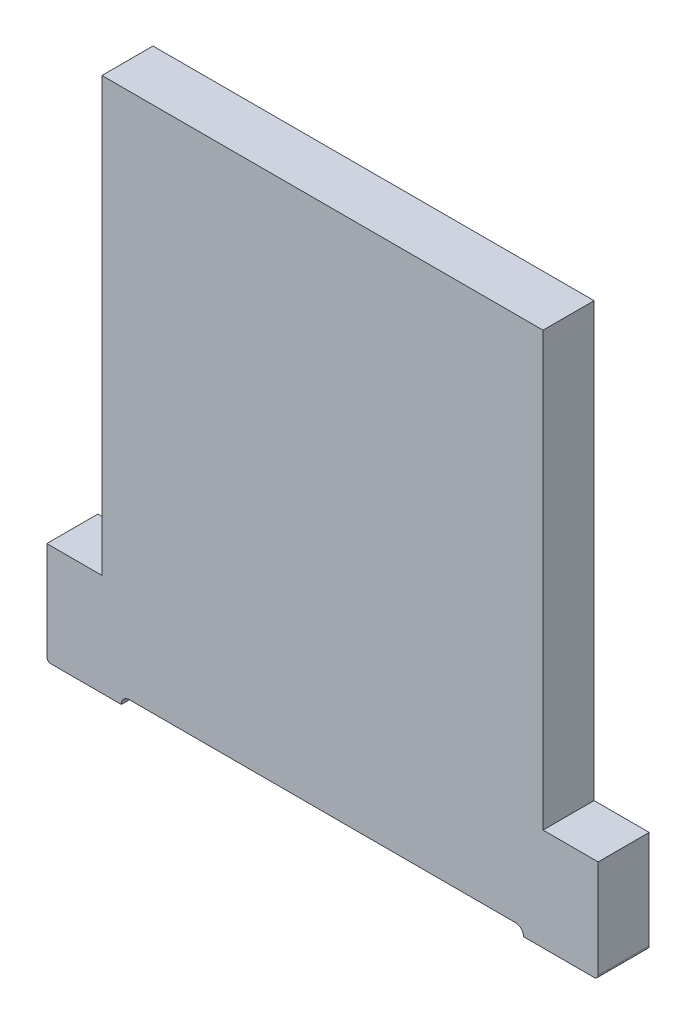
ISO-10303-21;
HEADER;
FILE_DESCRIPTION(('STEP AP214'),'2;1');
FILE_NAME('part.step','',(''),(''),'','','');
FILE_SCHEMA(('AUTOMOTIVE_DESIGN { 1 0 10303 214 1 1 1 1 }'));
ENDSEC;
DATA;
#1=APPLICATION_CONTEXT('core data for automotive mechanical design processes');
#2=APPLICATION_PROTOCOL_DEFINITION('international standard','automotive_design',2000,#1);
#3=PRODUCT_CONTEXT('',#1,'mechanical');
#4=PRODUCT('Part','Part','',(#3));
#5=PRODUCT_RELATED_PRODUCT_CATEGORY('part','',(#4));
#6=PRODUCT_DEFINITION_FORMATION('','',#4);
#7=PRODUCT_DEFINITION_CONTEXT('part definition',#1,'design');
#8=PRODUCT_DEFINITION('design','',#6,#7);
#9=PRODUCT_DEFINITION_SHAPE('','',#8);
#10=(LENGTH_UNIT() NAMED_UNIT(*) SI_UNIT(.MILLI.,.METRE.));
#11=(NAMED_UNIT(*) PLANE_ANGLE_UNIT() SI_UNIT($,.RADIAN.));
#12=(NAMED_UNIT(*) SI_UNIT($,.STERADIAN.) SOLID_ANGLE_UNIT());
#13=UNCERTAINTY_MEASURE_WITH_UNIT(LENGTH_MEASURE(1.E-05),#10,'distance_accuracy_value','');
#14=(GEOMETRIC_REPRESENTATION_CONTEXT(3) GLOBAL_UNCERTAINTY_ASSIGNED_CONTEXT((#13)) GLOBAL_UNIT_ASSIGNED_CONTEXT((#10,
#11,#12)) REPRESENTATION_CONTEXT('',''));
#15=CARTESIAN_POINT('',(0.,0.,0.));
#16=DIRECTION('',(0.,0.,1.));
#17=DIRECTION('',(1.,0.,0.));
#18=AXIS2_PLACEMENT_3D('',#15,#16,#17);
#19=CARTESIAN_POINT('',(131.144744279938,94.5570432923501,142.211582908599));
#20=DIRECTION('',(0.,1.,0.));
#21=DIRECTION('',(1.,0.,0.));
#22=AXIS2_PLACEMENT_3D('',#19,#20,#21);
#23=PLANE('',#22);
#24=DIRECTION('',(0.,0.,1.));
#25=VECTOR('',#24,1.);
#26=CARTESIAN_POINT('',(131.144744279938,94.5570432923501,142.211582908599));
#27=LINE('',#26,#25);
#28=CARTESIAN_POINT('',(131.144744279938,94.5570432923501,142.211582908599));
#29=VERTEX_POINT('',#28);
#30=CARTESIAN_POINT('',(131.144744279938,94.5570432923501,142.711582908599));
#31=VERTEX_POINT('',#30);
#32=EDGE_CURVE('E11',#29,#31,#27,.T.);
#33=ORIENTED_EDGE('',*,*,#32,.T.);
#34=DIRECTION('',(1.,0.,0.));
#35=VECTOR('',#34,1.);
#36=CARTESIAN_POINT('',(131.144744279938,94.5570432923501,142.711582908599));
#37=LINE('',#36,#35);
#38=CARTESIAN_POINT('',(131.684744279938,94.5570432923501,142.711582908599));
#39=VERTEX_POINT('',#38);
#40=EDGE_CURVE('E55',#31,#39,#37,.T.);
#41=ORIENTED_EDGE('',*,*,#40,.T.);
#42=DIRECTION('',(0.,0.,1.));
#43=VECTOR('',#42,1.);
#44=CARTESIAN_POINT('',(131.684744279938,94.5570432923501,142.211582908599));
#45=LINE('',#44,#43);
#46=CARTESIAN_POINT('',(131.684744279938,94.5570432923501,142.211582908599));
#47=VERTEX_POINT('',#46);
#48=EDGE_CURVE('E245',#47,#39,#45,.T.);
#49=ORIENTED_EDGE('',*,*,#48,.F.);
#50=DIRECTION('',(1.,0.,0.));
#51=VECTOR('',#50,1.);
#52=CARTESIAN_POINT('',(131.144744279938,94.5570432923501,142.211582908599));
#53=LINE('',#52,#51);
#54=EDGE_CURVE('E223',#29,#47,#53,.T.);
#55=ORIENTED_EDGE('',*,*,#54,.F.);
#56=EDGE_LOOP('',(#33,#41,#49,#55));
#57=FACE_BOUND('',#56,.T.);
#58=ADVANCED_FACE('F44',(#57),#23,.T.);
#59=CARTESIAN_POINT('',(131.684744279938,94.5570432923501,142.211582908599));
#60=DIRECTION('',(-1.,0.,0.));
#61=DIRECTION('',(0.,0.,1.));
#62=AXIS2_PLACEMENT_3D('',#59,#60,#61);
#63=PLANE('',#62);
#64=ORIENTED_EDGE('',*,*,#48,.T.);
#65=DIRECTION('',(0.,1.,0.));
#66=VECTOR('',#65,1.);
#67=CARTESIAN_POINT('',(131.684744279938,94.5570432923501,142.711582908599));
#68=LINE('',#67,#66);
#69=CARTESIAN_POINT('',(131.684744279938,98.7970432923501,142.711582908599));
#70=VERTEX_POINT('',#69);
#71=EDGE_CURVE('E227',#39,#70,#68,.T.);
#72=ORIENTED_EDGE('',*,*,#71,.T.);
#73=DIRECTION('',(0.,0.,1.));
#74=VECTOR('',#73,1.);
#75=CARTESIAN_POINT('',(131.684744279938,98.7970432923501,142.211582908599));
#76=LINE('',#75,#74);
#77=CARTESIAN_POINT('',(131.684744279938,98.7970432923501,142.211582908599));
#78=VERTEX_POINT('',#77);
#79=EDGE_CURVE('E225',#78,#70,#76,.T.);
#80=ORIENTED_EDGE('',*,*,#79,.F.);
#81=DIRECTION('',(0.,1.,0.));
#82=VECTOR('',#81,1.);
#83=CARTESIAN_POINT('',(131.684744279938,94.5570432923501,142.211582908599));
#84=LINE('',#83,#82);
#85=EDGE_CURVE('E220',#47,#78,#84,.T.);
#86=ORIENTED_EDGE('',*,*,#85,.F.);
#87=EDGE_LOOP('',(#64,#72,#80,#86));
#88=FACE_BOUND('',#87,.T.);
#89=ADVANCED_FACE('F305',(#88),#63,.T.);
#90=CARTESIAN_POINT('',(131.684744279938,98.7970432923501,142.211582908599));
#91=DIRECTION('',(0.,1.,0.));
#92=DIRECTION('',(1.,0.,0.));
#93=AXIS2_PLACEMENT_3D('',#90,#91,#92);
#94=PLANE('',#93);
#95=ORIENTED_EDGE('',*,*,#79,.T.);
#96=DIRECTION('',(1.,0.,0.));
#97=VECTOR('',#96,1.);
#98=CARTESIAN_POINT('',(131.684744279938,98.7970432923501,142.711582908599));
#99=LINE('',#98,#97);
#100=CARTESIAN_POINT('',(136.004744279938,98.7970432923501,142.711582908599));
#101=VERTEX_POINT('',#100);
#102=EDGE_CURVE('E228',#70,#101,#99,.T.);
#103=ORIENTED_EDGE('',*,*,#102,.T.);
#104=DIRECTION('',(0.,0.,1.));
#105=VECTOR('',#104,1.);
#106=CARTESIAN_POINT('',(136.004744279938,98.7970432923501,142.211582908599));
#107=LINE('',#106,#105);
#108=CARTESIAN_POINT('',(136.004744279938,98.7970432923501,142.211582908599));
#109=VERTEX_POINT('',#108);
#110=EDGE_CURVE('E233',#109,#101,#107,.T.);
#111=ORIENTED_EDGE('',*,*,#110,.F.);
#112=DIRECTION('',(1.,0.,0.));
#113=VECTOR('',#112,1.);
#114=CARTESIAN_POINT('',(131.684744279938,98.7970432923501,142.211582908599));
#115=LINE('',#114,#113);
#116=EDGE_CURVE('E224',#78,#109,#115,.T.);
#117=ORIENTED_EDGE('',*,*,#116,.F.);
#118=EDGE_LOOP('',(#95,#103,#111,#117));
#119=FACE_BOUND('',#118,.T.);
#120=ADVANCED_FACE('F418',(#119),#94,.T.);
#121=CARTESIAN_POINT('',(136.004744279938,98.7970432923501,142.211582908599));
#122=DIRECTION('',(1.,0.,0.));
#123=DIRECTION('',(0.,1.,0.));
#124=AXIS2_PLACEMENT_3D('',#121,#122,#123);
#125=PLANE('',#124);
#126=ORIENTED_EDGE('',*,*,#110,.T.);
#127=DIRECTION('',(0.,-1.,0.));
#128=VECTOR('',#127,1.);
#129=CARTESIAN_POINT('',(136.004744279938,98.7970432923501,142.711582908599));
#130=LINE('',#129,#128);
#131=CARTESIAN_POINT('',(136.004744279938,94.5570432923501,142.711582908599));
#132=VERTEX_POINT('',#131);
#133=EDGE_CURVE('E218',#101,#132,#130,.T.);
#134=ORIENTED_EDGE('',*,*,#133,.T.);
#135=DIRECTION('',(0.,0.,1.));
#136=VECTOR('',#135,1.);
#137=CARTESIAN_POINT('',(136.004744279938,94.5570432923501,142.211582908599));
#138=LINE('',#137,#136);
#139=CARTESIAN_POINT('',(136.004744279938,94.5570432923501,142.211582908599));
#140=VERTEX_POINT('',#139);
#141=EDGE_CURVE('E215',#140,#132,#138,.T.);
#142=ORIENTED_EDGE('',*,*,#141,.F.);
#143=DIRECTION('',(0.,-1.,0.));
#144=VECTOR('',#143,1.);
#145=CARTESIAN_POINT('',(136.004744279938,98.7970432923501,142.211582908599));
#146=LINE('',#145,#144);
#147=EDGE_CURVE('E286',#109,#140,#146,.T.);
#148=ORIENTED_EDGE('',*,*,#147,.F.);
#149=EDGE_LOOP('',(#126,#134,#142,#148));
#150=FACE_BOUND('',#149,.T.);
#151=ADVANCED_FACE('F414',(#150),#125,.T.);
#152=CARTESIAN_POINT('',(136.004744279938,94.5570432923501,142.211582908599));
#153=DIRECTION('',(0.,1.,0.));
#154=DIRECTION('',(1.,0.,0.));
#155=AXIS2_PLACEMENT_3D('',#152,#153,#154);
#156=PLANE('',#155);
#157=ORIENTED_EDGE('',*,*,#141,.T.);
#158=DIRECTION('',(1.,0.,0.));
#159=VECTOR('',#158,1.);
#160=CARTESIAN_POINT('',(136.004744279938,94.5570432923501,142.711582908599));
#161=LINE('',#160,#159);
#162=CARTESIAN_POINT('',(136.544744279938,94.5570432923501,142.711582908599));
#163=VERTEX_POINT('',#162);
#164=EDGE_CURVE('E219',#132,#163,#161,.T.);
#165=ORIENTED_EDGE('',*,*,#164,.T.);
#166=DIRECTION('',(0.,0.,1.));
#167=VECTOR('',#166,1.);
#168=CARTESIAN_POINT('',(136.544744279938,94.5570432923501,142.211582908599));
#169=LINE('',#168,#167);
#170=CARTESIAN_POINT('',(136.544744279938,94.5570432923501,142.211582908599));
#171=VERTEX_POINT('',#170);
#172=EDGE_CURVE('E270',#171,#163,#169,.T.);
#173=ORIENTED_EDGE('',*,*,#172,.F.);
#174=DIRECTION('',(1.,0.,0.));
#175=VECTOR('',#174,1.);
#176=CARTESIAN_POINT('',(136.004744279938,94.5570432923501,142.211582908599));
#177=LINE('',#176,#175);
#178=EDGE_CURVE('E283',#140,#171,#177,.T.);
#179=ORIENTED_EDGE('',*,*,#178,.F.);
#180=EDGE_LOOP('',(#157,#165,#173,#179));
#181=FACE_BOUND('',#180,.T.);
#182=ADVANCED_FACE('F353',(#181),#156,.T.);
#183=CARTESIAN_POINT('',(136.544744279938,94.5570432923501,142.211582908599));
#184=DIRECTION('',(1.,0.,0.));
#185=DIRECTION('',(0.,1.,0.));
#186=AXIS2_PLACEMENT_3D('',#183,#184,#185);
#187=PLANE('',#186);
#188=DIRECTION('',(0.,-1.,0.));
#189=VECTOR('',#188,1.);
#190=CARTESIAN_POINT('',(136.544744279938,94.5570432923501,142.211582908599));
#191=LINE('',#190,#189);
#192=CARTESIAN_POINT('',(136.544744279938,93.5970432923501,142.211582908599));
#193=VERTEX_POINT('',#192);
#194=EDGE_CURVE('E250',#171,#193,#191,.T.);
#195=ORIENTED_EDGE('',*,*,#194,.F.);
#196=ORIENTED_EDGE('',*,*,#172,.T.);
#197=DIRECTION('',(0.,-1.,0.));
#198=VECTOR('',#197,1.);
#199=CARTESIAN_POINT('',(136.544744279938,94.5570432923501,142.711582908599));
#200=LINE('',#199,#198);
#201=CARTESIAN_POINT('',(136.544744279938,93.5970432923501,142.711582908599));
#202=VERTEX_POINT('',#201);
#203=EDGE_CURVE('E214',#163,#202,#200,.T.);
#204=ORIENTED_EDGE('',*,*,#203,.T.);
#205=DIRECTION('',(0.,0.,1.));
#206=VECTOR('',#205,1.);
#207=CARTESIAN_POINT('',(136.544744279938,93.5970432923501,142.211582908599));
#208=LINE('',#207,#206);
#209=EDGE_CURVE('E211',#193,#202,#208,.T.);
#210=ORIENTED_EDGE('',*,*,#209,.F.);
#211=EDGE_LOOP('',(#195,#196,#204,#210));
#212=FACE_BOUND('',#211,.T.);
#213=ADVANCED_FACE('F347',(#212),#187,.T.);
#214=CARTESIAN_POINT('',(136.504744279938,93.5970432923501,142.211582908599));
#215=DIRECTION('',(0.,0.,1.));
#216=DIRECTION('',(0.,-1.,0.));
#217=AXIS2_PLACEMENT_3D('',#214,#215,#216);
#218=CYLINDRICAL_SURFACE('',#217,0.0399999999999983);
#219=CARTESIAN_POINT('',(136.504744279938,93.5970432923501,142.211582908599));
#220=DIRECTION('',(0.,0.,1.));
#221=DIRECTION('',(-1.,0.,0.));
#222=AXIS2_PLACEMENT_3D('',#219,#220,#221);
#223=CIRCLE('',#222,0.0400000000000123);
#224=CARTESIAN_POINT('',(136.504744279938,93.5570432923501,142.211582908599));
#225=VERTEX_POINT('',#224);
#226=EDGE_CURVE('E212',#225,#193,#223,.T.);
#227=ORIENTED_EDGE('',*,*,#226,.T.);
#228=ORIENTED_EDGE('',*,*,#209,.T.);
#229=CARTESIAN_POINT('',(136.504744279938,93.5970432923501,142.711582908599));
#230=DIRECTION('',(0.,0.,1.));
#231=DIRECTION('',(-1.,0.,0.));
#232=AXIS2_PLACEMENT_3D('',#229,#230,#231);
#233=CIRCLE('',#232,0.0400000000000123);
#234=CARTESIAN_POINT('',(136.504744279938,93.5570432923501,142.711582908599));
#235=VERTEX_POINT('',#234);
#236=EDGE_CURVE('E132',#235,#202,#233,.T.);
#237=ORIENTED_EDGE('',*,*,#236,.F.);
#238=DIRECTION('',(0.,0.,1.));
#239=VECTOR('',#238,1.);
#240=CARTESIAN_POINT('',(136.504744279938,93.5570432923501,142.211582908599));
#241=LINE('',#240,#239);
#242=EDGE_CURVE('E125',#225,#235,#241,.T.);
#243=ORIENTED_EDGE('',*,*,#242,.F.);
#244=EDGE_LOOP('',(#227,#228,#237,#243));
#245=FACE_BOUND('',#244,.T.);
#246=ADVANCED_FACE('F46',(#245),#218,.T.);
#247=CARTESIAN_POINT('',(133.844744279938,93.5570432923501,142.211582908599));
#248=DIRECTION('',(0.,-1.,0.));
#249=DIRECTION('',(0.,0.,-1.));
#250=AXIS2_PLACEMENT_3D('',#247,#248,#249);
#251=PLANE('',#250);
#252=DIRECTION('',(0.,0.,-1.));
#253=VECTOR('',#252,1.);
#254=CARTESIAN_POINT('',(135.814744279938,93.5570432923501,142.211582908599));
#255=LINE('',#254,#253);
#256=CARTESIAN_POINT('',(135.814744279938,93.5570432923501,142.711582908599));
#257=VERTEX_POINT('',#256);
#258=CARTESIAN_POINT('',(135.814744279938,93.5570432923501,142.211582908599));
#259=VERTEX_POINT('',#258);
#260=EDGE_CURVE('E238',#257,#259,#255,.T.);
#261=ORIENTED_EDGE('',*,*,#260,.T.);
#262=DIRECTION('',(1.,0.,0.));
#263=VECTOR('',#262,1.);
#264=CARTESIAN_POINT('',(131.144744279938,93.5570432923501,142.211582908599));
#265=LINE('',#264,#263);
#266=EDGE_CURVE('E234',#259,#225,#265,.T.);
#267=ORIENTED_EDGE('',*,*,#266,.T.);
#268=ORIENTED_EDGE('',*,*,#242,.T.);
#269=DIRECTION('',(-1.,0.,0.));
#270=VECTOR('',#269,1.);
#271=CARTESIAN_POINT('',(136.544744279938,93.5570432923501,142.711582908599));
#272=LINE('',#271,#270);
#273=EDGE_CURVE('E253',#235,#257,#272,.T.);
#274=ORIENTED_EDGE('',*,*,#273,.T.);
#275=EDGE_LOOP('',(#261,#267,#268,#274));
#276=FACE_BOUND('',#275,.T.);
#277=ADVANCED_FACE('F492',(#276),#251,.T.);
#278=CARTESIAN_POINT('',(135.734744279938,93.5570432923501,142.211582908599));
#279=DIRECTION('',(0.,0.,-1.));
#280=DIRECTION('',(0.,-1.,0.));
#281=AXIS2_PLACEMENT_3D('',#278,#279,#280);
#282=CYLINDRICAL_SURFACE('',#281,0.0799999999999967);
#283=CARTESIAN_POINT('',(135.734744279938,93.5570432923501,142.211582908599));
#284=DIRECTION('',(0.,0.,1.));
#285=DIRECTION('',(0.,-1.,0.));
#286=AXIS2_PLACEMENT_3D('',#283,#284,#285);
#287=CIRCLE('',#286,0.0799999999999967);
#288=CARTESIAN_POINT('',(135.734744279938,93.6370432923501,142.211582908599));
#289=VERTEX_POINT('',#288);
#290=EDGE_CURVE('E196',#259,#289,#287,.T.);
#291=ORIENTED_EDGE('',*,*,#290,.F.);
#292=ORIENTED_EDGE('',*,*,#260,.F.);
#293=CARTESIAN_POINT('',(135.734744279938,93.5570432923501,142.711582908599));
#294=DIRECTION('',(0.,0.,-1.));
#295=DIRECTION('',(0.,-1.,0.));
#296=AXIS2_PLACEMENT_3D('',#293,#294,#295);
#297=CIRCLE('',#296,0.0799999999999967);
#298=CARTESIAN_POINT('',(135.734744279938,93.6370432923501,142.711582908599));
#299=VERTEX_POINT('',#298);
#300=EDGE_CURVE('E281',#299,#257,#297,.T.);
#301=ORIENTED_EDGE('',*,*,#300,.F.);
#302=DIRECTION('',(0.,0.,1.));
#303=VECTOR('',#302,1.);
#304=CARTESIAN_POINT('',(135.734744279938,93.6370432923501,142.211582908599));
#305=LINE('',#304,#303);
#306=EDGE_CURVE('E254',#289,#299,#305,.T.);
#307=ORIENTED_EDGE('',*,*,#306,.F.);
#308=EDGE_LOOP('',(#291,#292,#301,#307));
#309=FACE_BOUND('',#308,.T.);
#310=ADVANCED_FACE('F488',(#309),#282,.F.);
#311=CARTESIAN_POINT('',(135.734744279938,93.6370432923501,142.211582908599));
#312=DIRECTION('',(0.,-1.,0.));
#313=DIRECTION('',(0.,0.,-1.));
#314=AXIS2_PLACEMENT_3D('',#311,#312,#313);
#315=PLANE('',#314);
#316=ORIENTED_EDGE('',*,*,#306,.T.);
#317=DIRECTION('',(-1.,0.,0.));
#318=VECTOR('',#317,1.);
#319=CARTESIAN_POINT('',(135.734744279938,93.6370432923501,142.711582908599));
#320=LINE('',#319,#318);
#321=CARTESIAN_POINT('',(131.954744279938,93.6370432923501,142.711582908599));
#322=VERTEX_POINT('',#321);
#323=EDGE_CURVE('E182',#299,#322,#320,.T.);
#324=ORIENTED_EDGE('',*,*,#323,.T.);
#325=DIRECTION('',(0.,0.,1.));
#326=VECTOR('',#325,1.);
#327=CARTESIAN_POINT('',(131.954744279938,93.6370432923501,142.211582908599));
#328=LINE('',#327,#326);
#329=CARTESIAN_POINT('',(131.954744279938,93.6370432923501,142.211582908599));
#330=VERTEX_POINT('',#329);
#331=EDGE_CURVE('E176',#330,#322,#328,.T.);
#332=ORIENTED_EDGE('',*,*,#331,.F.);
#333=DIRECTION('',(-1.,0.,0.));
#334=VECTOR('',#333,1.);
#335=CARTESIAN_POINT('',(135.734744279938,93.6370432923501,142.211582908599));
#336=LINE('',#335,#334);
#337=EDGE_CURVE('E180',#289,#330,#336,.T.);
#338=ORIENTED_EDGE('',*,*,#337,.F.);
#339=EDGE_LOOP('',(#316,#324,#332,#338));
#340=FACE_BOUND('',#339,.T.);
#341=ADVANCED_FACE('F179',(#340),#315,.T.);
#342=CARTESIAN_POINT('',(131.144744279938,93.5570432923501,142.211582908599));
#343=DIRECTION('',(-1.,0.,0.));
#344=DIRECTION('',(0.,0.,1.));
#345=AXIS2_PLACEMENT_3D('',#342,#343,#344);
#346=PLANE('',#345);
#347=DIRECTION('',(0.,1.,0.));
#348=VECTOR('',#347,1.);
#349=CARTESIAN_POINT('',(131.144744279938,93.5570432923501,142.211582908599));
#350=LINE('',#349,#348);
#351=CARTESIAN_POINT('',(131.144744279938,93.5970432923501,142.211582908599));
#352=VERTEX_POINT('',#351);
#353=EDGE_CURVE('E257',#352,#29,#350,.T.);
#354=ORIENTED_EDGE('',*,*,#353,.F.);
#355=DIRECTION('',(0.,0.,1.));
#356=VECTOR('',#355,1.);
#357=CARTESIAN_POINT('',(131.144744279938,93.5970432923501,142.211582908599));
#358=LINE('',#357,#356);
#359=CARTESIAN_POINT('',(131.144744279938,93.5970432923501,142.711582908599));
#360=VERTEX_POINT('',#359);
#361=EDGE_CURVE('E266',#352,#360,#358,.T.);
#362=ORIENTED_EDGE('',*,*,#361,.T.);
#363=DIRECTION('',(0.,1.,0.));
#364=VECTOR('',#363,1.);
#365=CARTESIAN_POINT('',(131.144744279938,93.5570432923501,142.711582908599));
#366=LINE('',#365,#364);
#367=EDGE_CURVE('E262',#360,#31,#366,.T.);
#368=ORIENTED_EDGE('',*,*,#367,.T.);
#369=ORIENTED_EDGE('',*,*,#32,.F.);
#370=EDGE_LOOP('',(#354,#362,#368,#369));
#371=FACE_BOUND('',#370,.T.);
#372=ADVANCED_FACE('F310',(#371),#346,.T.);
#373=CARTESIAN_POINT('',(133.844744279938,95.9618553224251,142.211582908599));
#374=DIRECTION('',(0.,0.,-1.));
#375=DIRECTION('',(0.,-1.,0.));
#376=AXIS2_PLACEMENT_3D('',#373,#374,#375);
#377=PLANE('',#376);
#378=DIRECTION('',(1.,0.,0.));
#379=VECTOR('',#378,1.);
#380=CARTESIAN_POINT('',(131.144744279938,93.5570432923501,142.211582908599));
#381=LINE('',#380,#379);
#382=CARTESIAN_POINT('',(131.184744279938,93.5570432923501,142.211582908599));
#383=VERTEX_POINT('',#382);
#384=CARTESIAN_POINT('',(131.874744279938,93.5570432923501,142.211582908599));
#385=VERTEX_POINT('',#384);
#386=EDGE_CURVE('E48',#383,#385,#381,.T.);
#387=ORIENTED_EDGE('',*,*,#386,.F.);
#388=CARTESIAN_POINT('',(131.184744279938,93.5970432923501,142.211582908599));
#389=DIRECTION('',(0.,0.,-1.));
#390=DIRECTION('',(-1.,0.,0.));
#391=AXIS2_PLACEMENT_3D('',#388,#389,#390);
#392=CIRCLE('',#391,0.0400000000000123);
#393=EDGE_CURVE('E261',#383,#352,#392,.T.);
#394=ORIENTED_EDGE('',*,*,#393,.T.);
#395=ORIENTED_EDGE('',*,*,#353,.T.);
#396=ORIENTED_EDGE('',*,*,#54,.T.);
#397=ORIENTED_EDGE('',*,*,#85,.T.);
#398=ORIENTED_EDGE('',*,*,#116,.T.);
#399=ORIENTED_EDGE('',*,*,#147,.T.);
#400=ORIENTED_EDGE('',*,*,#178,.T.);
#401=ORIENTED_EDGE('',*,*,#194,.T.);
#402=ORIENTED_EDGE('',*,*,#226,.F.);
#403=ORIENTED_EDGE('',*,*,#266,.F.);
#404=ORIENTED_EDGE('',*,*,#290,.T.);
#405=ORIENTED_EDGE('',*,*,#337,.T.);
#406=CARTESIAN_POINT('',(131.954744279938,93.5570432923501,142.211582908599));
#407=DIRECTION('',(0.,0.,1.));
#408=DIRECTION('',(0.,-1.,0.));
#409=AXIS2_PLACEMENT_3D('',#406,#407,#408);
#410=CIRCLE('',#409,0.0799999999999967);
#411=EDGE_CURVE('E193',#330,#385,#410,.T.);
#412=ORIENTED_EDGE('',*,*,#411,.T.);
#413=EDGE_LOOP('',(#387,#394,#395,#396,#397,#398,#399,#400,#401,#402,#403,#404,#405,#412));
#414=FACE_BOUND('',#413,.T.);
#415=ADVANCED_FACE('F192',(#414),#377,.T.);
#416=CARTESIAN_POINT('',(131.954744279938,93.5570432923501,142.211582908599));
#417=DIRECTION('',(0.,0.,-1.));
#418=DIRECTION('',(0.,-1.,0.));
#419=AXIS2_PLACEMENT_3D('',#416,#417,#418);
#420=CYLINDRICAL_SURFACE('',#419,0.0799999999999967);
#421=DIRECTION('',(0.,0.,-1.));
#422=VECTOR('',#421,1.);
#423=CARTESIAN_POINT('',(131.874744279938,93.5570432923501,142.211582908599));
#424=LINE('',#423,#422);
#425=CARTESIAN_POINT('',(131.874744279938,93.5570432923501,142.711582908599));
#426=VERTEX_POINT('',#425);
#427=EDGE_CURVE('E187',#426,#385,#424,.T.);
#428=ORIENTED_EDGE('',*,*,#427,.T.);
#429=ORIENTED_EDGE('',*,*,#411,.F.);
#430=ORIENTED_EDGE('',*,*,#331,.T.);
#431=CARTESIAN_POINT('',(131.954744279938,93.5570432923501,142.711582908599));
#432=DIRECTION('',(0.,0.,-1.));
#433=DIRECTION('',(0.,-1.,0.));
#434=AXIS2_PLACEMENT_3D('',#431,#432,#433);
#435=CIRCLE('',#434,0.0799999999999967);
#436=EDGE_CURVE('E188',#426,#322,#435,.T.);
#437=ORIENTED_EDGE('',*,*,#436,.F.);
#438=EDGE_LOOP('',(#428,#429,#430,#437));
#439=FACE_BOUND('',#438,.T.);
#440=ADVANCED_FACE('F200',(#439),#420,.F.);
#441=CARTESIAN_POINT('',(133.844744279938,95.9618553224251,142.711582908599));
#442=DIRECTION('',(0.,0.,-1.));
#443=DIRECTION('',(0.,-1.,0.));
#444=AXIS2_PLACEMENT_3D('',#441,#442,#443);
#445=PLANE('',#444);
#446=DIRECTION('',(-1.,0.,0.));
#447=VECTOR('',#446,1.);
#448=CARTESIAN_POINT('',(136.544744279938,93.5570432923501,142.711582908599));
#449=LINE('',#448,#447);
#450=CARTESIAN_POINT('',(131.184744279938,93.5570432923501,142.711582908599));
#451=VERTEX_POINT('',#450);
#452=EDGE_CURVE('E316',#426,#451,#449,.T.);
#453=ORIENTED_EDGE('',*,*,#452,.F.);
#454=ORIENTED_EDGE('',*,*,#436,.T.);
#455=ORIENTED_EDGE('',*,*,#323,.F.);
#456=ORIENTED_EDGE('',*,*,#300,.T.);
#457=ORIENTED_EDGE('',*,*,#273,.F.);
#458=ORIENTED_EDGE('',*,*,#236,.T.);
#459=ORIENTED_EDGE('',*,*,#203,.F.);
#460=ORIENTED_EDGE('',*,*,#164,.F.);
#461=ORIENTED_EDGE('',*,*,#133,.F.);
#462=ORIENTED_EDGE('',*,*,#102,.F.);
#463=ORIENTED_EDGE('',*,*,#71,.F.);
#464=ORIENTED_EDGE('',*,*,#40,.F.);
#465=ORIENTED_EDGE('',*,*,#367,.F.);
#466=CARTESIAN_POINT('',(131.184744279938,93.5970432923501,142.711582908599));
#467=DIRECTION('',(0.,0.,-1.));
#468=DIRECTION('',(-1.,0.,0.));
#469=AXIS2_PLACEMENT_3D('',#466,#467,#468);
#470=CIRCLE('',#469,0.0400000000000123);
#471=EDGE_CURVE('E287',#451,#360,#470,.T.);
#472=ORIENTED_EDGE('',*,*,#471,.F.);
#473=EDGE_LOOP('',(#453,#454,#455,#456,#457,#458,#459,#460,#461,#462,#463,#464,#465,#472));
#474=FACE_BOUND('',#473,.T.);
#475=ADVANCED_FACE('F301',(#474),#445,.F.);
#476=CARTESIAN_POINT('',(131.184744279938,93.5970432923501,142.211582908599));
#477=DIRECTION('',(0.,0.,1.));
#478=DIRECTION('',(0.,-1.,0.));
#479=AXIS2_PLACEMENT_3D('',#476,#477,#478);
#480=CYLINDRICAL_SURFACE('',#479,0.0399999999999983);
#481=DIRECTION('',(0.,0.,1.));
#482=VECTOR('',#481,1.);
#483=CARTESIAN_POINT('',(131.184744279938,93.5570432923501,142.211582908599));
#484=LINE('',#483,#482);
#485=EDGE_CURVE('E282',#383,#451,#484,.T.);
#486=ORIENTED_EDGE('',*,*,#485,.T.);
#487=ORIENTED_EDGE('',*,*,#471,.T.);
#488=ORIENTED_EDGE('',*,*,#361,.F.);
#489=ORIENTED_EDGE('',*,*,#393,.F.);
#490=EDGE_LOOP('',(#486,#487,#488,#489));
#491=FACE_BOUND('',#490,.T.);
#492=ADVANCED_FACE('F320',(#491),#480,.T.);
#493=CARTESIAN_POINT('',(133.844744279938,93.5570432923501,142.211582908599));
#494=DIRECTION('',(0.,-1.,0.));
#495=DIRECTION('',(0.,0.,-1.));
#496=AXIS2_PLACEMENT_3D('',#493,#494,#495);
#497=PLANE('',#496);
#498=ORIENTED_EDGE('',*,*,#485,.F.);
#499=ORIENTED_EDGE('',*,*,#386,.T.);
#500=ORIENTED_EDGE('',*,*,#427,.F.);
#501=ORIENTED_EDGE('',*,*,#452,.T.);
#502=EDGE_LOOP('',(#498,#499,#500,#501));
#503=FACE_BOUND('',#502,.T.);
#504=ADVANCED_FACE('F369',(#503),#497,.T.);
#505=CLOSED_SHELL('',(#58,#89,#120,#151,#182,#213,#246,#277,#310,#341,#372,#415,#440,#475,#492,#504));
#506=MANIFOLD_SOLID_BREP('B2',#505);
#507=ADVANCED_BREP_SHAPE_REPRESENTATION('',(#18,#506),#14);
#508=SHAPE_DEFINITION_REPRESENTATION(#9,#507);
ENDSEC;
END-ISO-10303-21;
